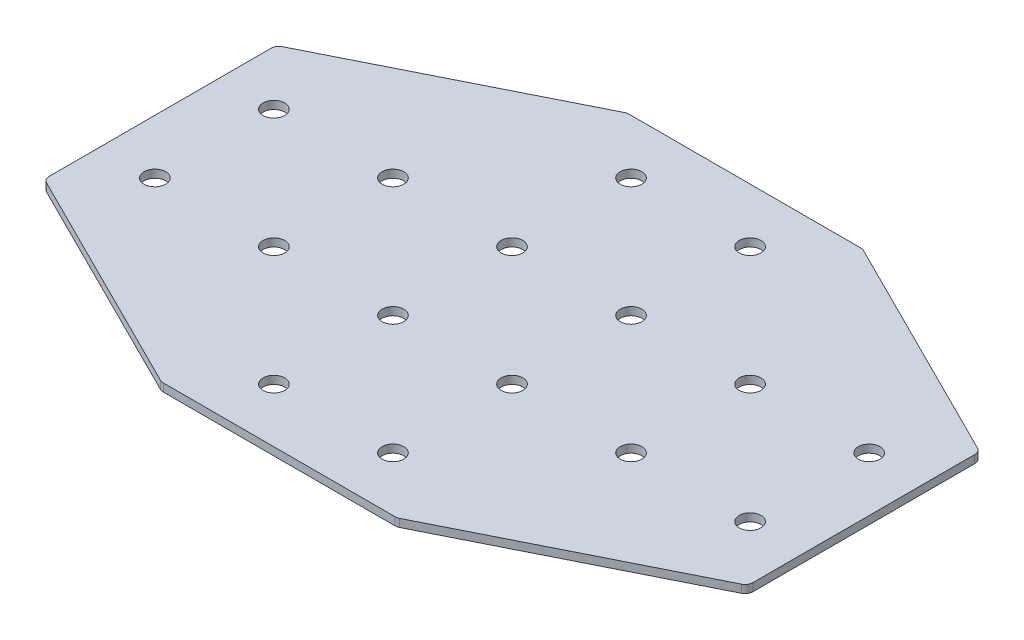
ISO-10303-21;
HEADER;
FILE_DESCRIPTION(('STEP AP214'),'2;1');
FILE_NAME('part.step','',(''),(''),'','','');
FILE_SCHEMA(('AUTOMOTIVE_DESIGN { 1 0 10303 214 1 1 1 1 }'));
ENDSEC;
DATA;
#1=APPLICATION_CONTEXT('core data for automotive mechanical design processes');
#2=APPLICATION_PROTOCOL_DEFINITION('international standard','automotive_design',2000,#1);
#3=PRODUCT_CONTEXT('',#1,'mechanical');
#4=PRODUCT('Part','Part','',(#3));
#5=PRODUCT_RELATED_PRODUCT_CATEGORY('part','',(#4));
#6=PRODUCT_DEFINITION_FORMATION('','',#4);
#7=PRODUCT_DEFINITION_CONTEXT('part definition',#1,'design');
#8=PRODUCT_DEFINITION('design','',#6,#7);
#9=PRODUCT_DEFINITION_SHAPE('','',#8);
#10=(LENGTH_UNIT() NAMED_UNIT(*) SI_UNIT(.MILLI.,.METRE.));
#11=(NAMED_UNIT(*) PLANE_ANGLE_UNIT() SI_UNIT($,.RADIAN.));
#12=(NAMED_UNIT(*) SI_UNIT($,.STERADIAN.) SOLID_ANGLE_UNIT());
#13=UNCERTAINTY_MEASURE_WITH_UNIT(LENGTH_MEASURE(1.E-05),#10,'distance_accuracy_value','');
#14=(GEOMETRIC_REPRESENTATION_CONTEXT(3) GLOBAL_UNCERTAINTY_ASSIGNED_CONTEXT((#13)) GLOBAL_UNIT_ASSIGNED_CONTEXT((#10,
#11,#12)) REPRESENTATION_CONTEXT('',''));
#15=CARTESIAN_POINT('',(0.,0.,0.));
#16=DIRECTION('',(0.,0.,1.));
#17=DIRECTION('',(1.,0.,0.));
#18=AXIS2_PLACEMENT_3D('',#15,#16,#17);
#19=CARTESIAN_POINT('',(-1.5038164553971,0.55807034319605,-0.553919420894999));
#20=DIRECTION('',(0.,-1.,0.));
#21=DIRECTION('',(0.,0.,-1.));
#22=AXIS2_PLACEMENT_3D('',#19,#20,#21);
#23=PLANE('',#22);
#24=CARTESIAN_POINT('',(-24.0038164553971,0.55807034319605,21.946080579105));
#25=DIRECTION('',(0.,-1.,0.));
#26=DIRECTION('',(0.,0.,1.));
#27=AXIS2_PLACEMENT_3D('',#24,#25,#26);
#28=CIRCLE('',#27,4.1);
#29=CARTESIAN_POINT('',(-24.0038164553971,0.55807034319605,26.046080579105));
#30=VERTEX_POINT('',#29);
#31=EDGE_CURVE('E140',#30,#30,#28,.T.);
#32=ORIENTED_EDGE('',*,*,#31,.F.);
#33=EDGE_LOOP('',(#32));
#34=FACE_BOUND('',#33,.T.);
#35=CARTESIAN_POINT('',(-24.0038164553971,0.55807034319605,66.946080579105));
#36=DIRECTION('',(0.,-1.,0.));
#37=DIRECTION('',(0.,0.,1.));
#38=AXIS2_PLACEMENT_3D('',#35,#36,#37);
#39=CIRCLE('',#38,4.1);
#40=CARTESIAN_POINT('',(-24.0038164553971,0.55807034319605,71.046080579105));
#41=VERTEX_POINT('',#40);
#42=EDGE_CURVE('E243',#41,#41,#39,.T.);
#43=ORIENTED_EDGE('',*,*,#42,.F.);
#44=EDGE_LOOP('',(#43));
#45=FACE_BOUND('',#44,.T.);
#46=CARTESIAN_POINT('',(-69.0038164553971,0.55807034319605,21.946080579105));
#47=DIRECTION('',(0.,-1.,0.));
#48=DIRECTION('',(0.,0.,1.));
#49=AXIS2_PLACEMENT_3D('',#46,#47,#48);
#50=CIRCLE('',#49,4.09999999999999);
#51=CARTESIAN_POINT('',(-69.0038164553971,0.55807034319605,26.046080579105));
#52=VERTEX_POINT('',#51);
#53=EDGE_CURVE('E237',#52,#52,#50,.T.);
#54=ORIENTED_EDGE('',*,*,#53,.F.);
#55=EDGE_LOOP('',(#54));
#56=FACE_BOUND('',#55,.T.);
#57=CARTESIAN_POINT('',(-114.003816455397,0.55807034319605,21.946080579105));
#58=DIRECTION('',(0.,-1.,0.));
#59=DIRECTION('',(0.,0.,1.));
#60=AXIS2_PLACEMENT_3D('',#57,#58,#59);
#61=CIRCLE('',#60,4.1);
#62=CARTESIAN_POINT('',(-114.003816455397,0.55807034319605,26.046080579105));
#63=VERTEX_POINT('',#62);
#64=EDGE_CURVE('E231',#63,#63,#61,.T.);
#65=ORIENTED_EDGE('',*,*,#64,.F.);
#66=EDGE_LOOP('',(#65));
#67=FACE_BOUND('',#66,.T.);
#68=CARTESIAN_POINT('',(20.9961835446029,0.55807034319605,21.946080579105));
#69=DIRECTION('',(0.,1.,0.));
#70=DIRECTION('',(0.,0.,1.));
#71=AXIS2_PLACEMENT_3D('',#68,#69,#70);
#72=CIRCLE('',#71,4.1);
#73=CARTESIAN_POINT('',(20.9961835446029,0.55807034319605,26.046080579105));
#74=VERTEX_POINT('',#73);
#75=EDGE_CURVE('E298',#74,#74,#72,.T.);
#76=ORIENTED_EDGE('',*,*,#75,.T.);
#77=EDGE_LOOP('',(#76));
#78=FACE_BOUND('',#77,.T.);
#79=CARTESIAN_POINT('',(20.9961835446029,0.55807034319605,66.946080579105));
#80=DIRECTION('',(0.,1.,0.));
#81=DIRECTION('',(0.,0.,1.));
#82=AXIS2_PLACEMENT_3D('',#79,#80,#81);
#83=CIRCLE('',#82,4.1);
#84=CARTESIAN_POINT('',(20.9961835446029,0.55807034319605,71.046080579105));
#85=VERTEX_POINT('',#84);
#86=EDGE_CURVE('E292',#85,#85,#83,.T.);
#87=ORIENTED_EDGE('',*,*,#86,.T.);
#88=EDGE_LOOP('',(#87));
#89=FACE_BOUND('',#88,.T.);
#90=CARTESIAN_POINT('',(65.9961835446029,0.55807034319605,21.946080579105));
#91=DIRECTION('',(0.,1.,0.));
#92=DIRECTION('',(0.,0.,1.));
#93=AXIS2_PLACEMENT_3D('',#90,#91,#92);
#94=CIRCLE('',#93,4.09999999999999);
#95=CARTESIAN_POINT('',(65.9961835446029,0.55807034319605,26.046080579105));
#96=VERTEX_POINT('',#95);
#97=EDGE_CURVE('E286',#96,#96,#94,.T.);
#98=ORIENTED_EDGE('',*,*,#97,.T.);
#99=EDGE_LOOP('',(#98));
#100=FACE_BOUND('',#99,.T.);
#101=CARTESIAN_POINT('',(110.996183544603,0.55807034319605,21.946080579105));
#102=DIRECTION('',(0.,1.,0.));
#103=DIRECTION('',(0.,0.,1.));
#104=AXIS2_PLACEMENT_3D('',#101,#102,#103);
#105=CIRCLE('',#104,4.1);
#106=CARTESIAN_POINT('',(110.996183544603,0.55807034319605,26.046080579105));
#107=VERTEX_POINT('',#106);
#108=EDGE_CURVE('E280',#107,#107,#105,.T.);
#109=ORIENTED_EDGE('',*,*,#108,.T.);
#110=EDGE_LOOP('',(#109));
#111=FACE_BOUND('',#110,.T.);
#112=DIRECTION('',(0.,0.,-1.));
#113=VECTOR('',#112,1.);
#114=CARTESIAN_POINT('',(-134.503816455397,0.55807034319605,43.2100126016053));
#115=LINE('',#114,#113);
#116=CARTESIAN_POINT('',(-134.503816455397,0.55807034319605,41.3559106353556));
#117=VERTEX_POINT('',#116);
#118=CARTESIAN_POINT('',(-134.503816455397,0.55807034319605,-42.4637494771456));
#119=VERTEX_POINT('',#118);
#120=EDGE_CURVE('E253',#117,#119,#115,.T.);
#121=ORIENTED_EDGE('',*,*,#120,.T.);
#122=CARTESIAN_POINT('',(-131.503816455397,0.55807034319605,-42.4637494771456));
#123=DIRECTION('',(0.,-1.,0.));
#124=DIRECTION('',(0.,0.,1.));
#125=AXIS2_PLACEMENT_3D('',#122,#123,#124);
#126=CIRCLE('',#125,3.);
#127=CARTESIAN_POINT('',(-132.845457241897,0.55807034319605,-45.1470310501454));
#128=VERTEX_POINT('',#127);
#129=EDGE_CURVE('E148',#119,#128,#126,.T.);
#130=ORIENTED_EDGE('',*,*,#129,.T.);
#131=DIRECTION('',(-0.894427190999916,0.,0.447213595499958));
#132=VECTOR('',#131,1.);
#133=CARTESIAN_POINT('',(-46.0316805003976,0.55807034319605,-88.553919420895));
#134=LINE('',#133,#132);
#135=CARTESIAN_POINT('',(-46.6651173543981,0.55807034319605,-88.2372009938947));
#136=VERTEX_POINT('',#135);
#137=EDGE_CURVE('E158',#136,#128,#134,.T.);
#138=ORIENTED_EDGE('',*,*,#137,.F.);
#139=CARTESIAN_POINT('',(-45.3234765678982,0.55807034319605,-85.553919420895));
#140=DIRECTION('',(0.,-1.,0.));
#141=DIRECTION('',(0.,0.,1.));
#142=AXIS2_PLACEMENT_3D('',#139,#140,#141);
#143=CIRCLE('',#142,3.);
#144=CARTESIAN_POINT('',(-45.3234765678982,0.55807034319605,-88.553919420895));
#145=VERTEX_POINT('',#144);
#146=EDGE_CURVE('E168',#136,#145,#143,.T.);
#147=ORIENTED_EDGE('',*,*,#146,.T.);
#148=DIRECTION('',(1.,0.,0.));
#149=VECTOR('',#148,1.);
#150=CARTESIAN_POINT('',(-44.5038164553972,0.55807034319605,-88.553919420895));
#151=LINE('',#150,#149);
#152=CARTESIAN_POINT('',(42.3158436571041,0.55807034319605,-88.553919420895));
#153=VERTEX_POINT('',#152);
#154=EDGE_CURVE('E198',#145,#153,#151,.T.);
#155=ORIENTED_EDGE('',*,*,#154,.T.);
#156=CARTESIAN_POINT('',(42.3158436571041,0.55807034319605,-85.553919420895));
#157=DIRECTION('',(0.,1.,0.));
#158=DIRECTION('',(0.,0.,1.));
#159=AXIS2_PLACEMENT_3D('',#156,#157,#158);
#160=CIRCLE('',#159,3.);
#161=CARTESIAN_POINT('',(43.6574844436039,0.55807034319605,-88.2372009938947));
#162=VERTEX_POINT('',#161);
#163=EDGE_CURVE('E220',#162,#153,#160,.T.);
#164=ORIENTED_EDGE('',*,*,#163,.F.);
#165=DIRECTION('',(0.894427190999916,0.,0.447213595499958));
#166=VECTOR('',#165,1.);
#167=CARTESIAN_POINT('',(43.0240475896034,0.55807034319605,-88.553919420895));
#168=LINE('',#167,#166);
#169=CARTESIAN_POINT('',(129.837824331103,0.55807034319605,-45.1470310501453));
#170=VERTEX_POINT('',#169);
#171=EDGE_CURVE('E201',#162,#170,#168,.T.);
#172=ORIENTED_EDGE('',*,*,#171,.T.);
#173=CARTESIAN_POINT('',(128.496183544603,0.55807034319605,-42.4637494771456));
#174=DIRECTION('',(0.,1.,0.));
#175=DIRECTION('',(0.,0.,1.));
#176=AXIS2_PLACEMENT_3D('',#173,#174,#175);
#177=CIRCLE('',#176,3.);
#178=CARTESIAN_POINT('',(131.496183544603,0.55807034319605,-42.4637494771456));
#179=VERTEX_POINT('',#178);
#180=EDGE_CURVE('E217',#179,#170,#177,.T.);
#181=ORIENTED_EDGE('',*,*,#180,.F.);
#182=DIRECTION('',(0.,0.,-1.));
#183=VECTOR('',#182,1.);
#184=CARTESIAN_POINT('',(131.496183544603,0.55807034319605,43.2100126016053));
#185=LINE('',#184,#183);
#186=CARTESIAN_POINT('',(131.496183544603,0.55807034319605,41.3559106353556));
#187=VERTEX_POINT('',#186);
#188=EDGE_CURVE('E304',#187,#179,#185,.T.);
#189=ORIENTED_EDGE('',*,*,#188,.F.);
#190=CARTESIAN_POINT('',(128.496183544603,0.55807034319605,41.3559106353556));
#191=DIRECTION('',(0.,-1.,0.));
#192=DIRECTION('',(0.,0.,-1.));
#193=AXIS2_PLACEMENT_3D('',#190,#191,#192);
#194=CIRCLE('',#193,3.);
#195=CARTESIAN_POINT('',(129.837824331103,0.55807034319605,44.0391922083553));
#196=VERTEX_POINT('',#195);
#197=EDGE_CURVE('E31',#187,#196,#194,.T.);
#198=ORIENTED_EDGE('',*,*,#197,.T.);
#199=DIRECTION('',(0.894427190999916,0.,-0.447213595499958));
#200=VECTOR('',#199,1.);
#201=CARTESIAN_POINT('',(43.0240475896034,0.55807034319605,87.446080579105));
#202=LINE('',#201,#200);
#203=CARTESIAN_POINT('',(43.6574844436039,0.55807034319605,87.1293621521047));
#204=VERTEX_POINT('',#203);
#205=EDGE_CURVE('E309',#204,#196,#202,.T.);
#206=ORIENTED_EDGE('',*,*,#205,.F.);
#207=CARTESIAN_POINT('',(42.3158436571041,0.55807034319605,84.446080579105));
#208=DIRECTION('',(0.,-1.,0.));
#209=DIRECTION('',(0.,0.,-1.));
#210=AXIS2_PLACEMENT_3D('',#207,#208,#209);
#211=CIRCLE('',#210,3.);
#212=CARTESIAN_POINT('',(42.3158436571041,0.55807034319605,87.446080579105));
#213=VERTEX_POINT('',#212);
#214=EDGE_CURVE('E324',#204,#213,#211,.T.);
#215=ORIENTED_EDGE('',*,*,#214,.T.);
#216=DIRECTION('',(1.,0.,0.));
#217=VECTOR('',#216,1.);
#218=CARTESIAN_POINT('',(-44.5038164553972,0.55807034319605,87.446080579105));
#219=LINE('',#218,#217);
#220=CARTESIAN_POINT('',(-45.3234765678982,0.55807034319605,87.446080579105));
#221=VERTEX_POINT('',#220);
#222=EDGE_CURVE('E306',#221,#213,#219,.T.);
#223=ORIENTED_EDGE('',*,*,#222,.F.);
#224=CARTESIAN_POINT('',(-45.3234765678982,0.55807034319605,84.446080579105));
#225=DIRECTION('',(0.,1.,0.));
#226=DIRECTION('',(0.,0.,-1.));
#227=AXIS2_PLACEMENT_3D('',#224,#225,#226);
#228=CIRCLE('',#227,3.);
#229=CARTESIAN_POINT('',(-46.6651173543981,0.55807034319605,87.1293621521047));
#230=VERTEX_POINT('',#229);
#231=EDGE_CURVE('E270',#230,#221,#228,.T.);
#232=ORIENTED_EDGE('',*,*,#231,.F.);
#233=DIRECTION('',(-0.894427190999916,0.,-0.447213595499958));
#234=VECTOR('',#233,1.);
#235=CARTESIAN_POINT('',(-46.0316805003976,0.55807034319605,87.446080579105));
#236=LINE('',#235,#234);
#237=CARTESIAN_POINT('',(-132.845457241897,0.55807034319605,44.0391922083554));
#238=VERTEX_POINT('',#237);
#239=EDGE_CURVE('E255',#230,#238,#236,.T.);
#240=ORIENTED_EDGE('',*,*,#239,.T.);
#241=CARTESIAN_POINT('',(-131.503816455397,0.55807034319605,41.3559106353556));
#242=DIRECTION('',(0.,1.,0.));
#243=DIRECTION('',(0.,0.,-1.));
#244=AXIS2_PLACEMENT_3D('',#241,#242,#243);
#245=CIRCLE('',#244,3.);
#246=EDGE_CURVE('E267',#117,#238,#245,.T.);
#247=ORIENTED_EDGE('',*,*,#246,.F.);
#248=EDGE_LOOP('',(#121,#130,#138,#147,#155,#164,#172,#181,#189,#198,#206,#215,#223,#232,#240,#247));
#249=FACE_BOUND('',#248,.T.);
#250=CARTESIAN_POINT('',(-24.0038164553971,0.55807034319605,-23.053919420895));
#251=DIRECTION('',(0.,1.,0.));
#252=DIRECTION('',(0.,0.,-1.));
#253=AXIS2_PLACEMENT_3D('',#250,#251,#252);
#254=CIRCLE('',#253,4.1);
#255=CARTESIAN_POINT('',(-24.0038164553971,0.55807034319605,-27.153919420895));
#256=VERTEX_POINT('',#255);
#257=EDGE_CURVE('E352',#256,#256,#254,.T.);
#258=ORIENTED_EDGE('',*,*,#257,.T.);
#259=EDGE_LOOP('',(#258));
#260=FACE_BOUND('',#259,.T.);
#261=CARTESIAN_POINT('',(-24.0038164553971,0.55807034319605,-68.053919420895));
#262=DIRECTION('',(0.,1.,0.));
#263=DIRECTION('',(0.,0.,-1.));
#264=AXIS2_PLACEMENT_3D('',#261,#262,#263);
#265=CIRCLE('',#264,4.1);
#266=CARTESIAN_POINT('',(-24.0038164553971,0.55807034319605,-72.153919420895));
#267=VERTEX_POINT('',#266);
#268=EDGE_CURVE('E356',#267,#267,#265,.T.);
#269=ORIENTED_EDGE('',*,*,#268,.T.);
#270=EDGE_LOOP('',(#269));
#271=FACE_BOUND('',#270,.T.);
#272=CARTESIAN_POINT('',(-69.0038164553971,0.55807034319605,-23.053919420895));
#273=DIRECTION('',(0.,1.,0.));
#274=DIRECTION('',(0.,0.,-1.));
#275=AXIS2_PLACEMENT_3D('',#272,#273,#274);
#276=CIRCLE('',#275,4.09999999999999);
#277=CARTESIAN_POINT('',(-69.0038164553971,0.55807034319605,-27.153919420895));
#278=VERTEX_POINT('',#277);
#279=EDGE_CURVE('E360',#278,#278,#276,.T.);
#280=ORIENTED_EDGE('',*,*,#279,.T.);
#281=EDGE_LOOP('',(#280));
#282=FACE_BOUND('',#281,.T.);
#283=CARTESIAN_POINT('',(-114.003816455397,0.55807034319605,-23.053919420895));
#284=DIRECTION('',(0.,1.,0.));
#285=DIRECTION('',(0.,0.,-1.));
#286=AXIS2_PLACEMENT_3D('',#283,#284,#285);
#287=CIRCLE('',#286,4.1);
#288=CARTESIAN_POINT('',(-114.003816455397,0.55807034319605,-27.153919420895));
#289=VERTEX_POINT('',#288);
#290=EDGE_CURVE('E364',#289,#289,#287,.T.);
#291=ORIENTED_EDGE('',*,*,#290,.T.);
#292=EDGE_LOOP('',(#291));
#293=FACE_BOUND('',#292,.T.);
#294=CARTESIAN_POINT('',(20.9961835446029,0.55807034319605,-23.053919420895));
#295=DIRECTION('',(0.,-1.,0.));
#296=DIRECTION('',(0.,0.,-1.));
#297=AXIS2_PLACEMENT_3D('',#294,#295,#296);
#298=CIRCLE('',#297,4.1);
#299=CARTESIAN_POINT('',(20.9961835446029,0.55807034319605,-27.153919420895));
#300=VERTEX_POINT('',#299);
#301=EDGE_CURVE('E192',#300,#300,#298,.T.);
#302=ORIENTED_EDGE('',*,*,#301,.F.);
#303=EDGE_LOOP('',(#302));
#304=FACE_BOUND('',#303,.T.);
#305=CARTESIAN_POINT('',(20.9961835446029,0.55807034319605,-68.053919420895));
#306=DIRECTION('',(0.,-1.,0.));
#307=DIRECTION('',(0.,0.,-1.));
#308=AXIS2_PLACEMENT_3D('',#305,#306,#307);
#309=CIRCLE('',#308,4.1);
#310=CARTESIAN_POINT('',(20.9961835446029,0.55807034319605,-72.153919420895));
#311=VERTEX_POINT('',#310);
#312=EDGE_CURVE('E186',#311,#311,#309,.T.);
#313=ORIENTED_EDGE('',*,*,#312,.F.);
#314=EDGE_LOOP('',(#313));
#315=FACE_BOUND('',#314,.T.);
#316=CARTESIAN_POINT('',(65.9961835446029,0.55807034319605,-23.053919420895));
#317=DIRECTION('',(0.,-1.,0.));
#318=DIRECTION('',(0.,0.,-1.));
#319=AXIS2_PLACEMENT_3D('',#316,#317,#318);
#320=CIRCLE('',#319,4.09999999999999);
#321=CARTESIAN_POINT('',(65.9961835446029,0.55807034319605,-27.153919420895));
#322=VERTEX_POINT('',#321);
#323=EDGE_CURVE('E180',#322,#322,#320,.T.);
#324=ORIENTED_EDGE('',*,*,#323,.F.);
#325=EDGE_LOOP('',(#324));
#326=FACE_BOUND('',#325,.T.);
#327=CARTESIAN_POINT('',(110.996183544603,0.55807034319605,-23.053919420895));
#328=DIRECTION('',(0.,-1.,0.));
#329=DIRECTION('',(0.,0.,-1.));
#330=AXIS2_PLACEMENT_3D('',#327,#328,#329);
#331=CIRCLE('',#330,4.1);
#332=CARTESIAN_POINT('',(110.996183544603,0.55807034319605,-27.153919420895));
#333=VERTEX_POINT('',#332);
#334=EDGE_CURVE('E174',#333,#333,#331,.T.);
#335=ORIENTED_EDGE('',*,*,#334,.F.);
#336=EDGE_LOOP('',(#335));
#337=FACE_BOUND('',#336,.T.);
#338=ADVANCED_FACE('F16',(#34,#45,#56,#67,#78,#89,#100,#111,#249,#260,#271,#282,#293,#304,#315,
#326,#337),#23,.T.);
#339=CARTESIAN_POINT('',(131.496183544603,0.55807034319605,43.2100126016053));
#340=DIRECTION('',(1.,0.,0.));
#341=DIRECTION('',(0.,0.,-1.));
#342=AXIS2_PLACEMENT_3D('',#339,#340,#341);
#343=PLANE('',#342);
#344=ORIENTED_EDGE('',*,*,#188,.T.);
#345=DIRECTION('',(0.,1.,0.));
#346=VECTOR('',#345,1.);
#347=CARTESIAN_POINT('',(131.496183544603,0.55807034319605,-42.4637494771456));
#348=LINE('',#347,#346);
#349=CARTESIAN_POINT('',(131.496183544603,3.55807034319605,-42.4637494771456));
#350=VERTEX_POINT('',#349);
#351=EDGE_CURVE('E227',#350,#179,#348,.F.);
#352=ORIENTED_EDGE('',*,*,#351,.F.);
#353=DIRECTION('',(0.,0.,-1.));
#354=VECTOR('',#353,1.);
#355=CARTESIAN_POINT('',(131.496183544603,3.55807034319605,43.2100126016053));
#356=LINE('',#355,#354);
#357=CARTESIAN_POINT('',(131.496183544603,3.55807034319605,41.3559106353556));
#358=VERTEX_POINT('',#357);
#359=EDGE_CURVE('E301',#358,#350,#356,.T.);
#360=ORIENTED_EDGE('',*,*,#359,.F.);
#361=DIRECTION('',(0.,1.,0.));
#362=VECTOR('',#361,1.);
#363=CARTESIAN_POINT('',(131.496183544603,0.55807034319605,41.3559106353556));
#364=LINE('',#363,#362);
#365=EDGE_CURVE('E10',#358,#187,#364,.F.);
#366=ORIENTED_EDGE('',*,*,#365,.T.);
#367=EDGE_LOOP('',(#344,#352,#360,#366));
#368=FACE_BOUND('',#367,.T.);
#369=ADVANCED_FACE('F346',(#368),#343,.T.);
#370=CARTESIAN_POINT('',(-1.5038164553971,3.55807034319605,-0.553919420894999));
#371=DIRECTION('',(0.,-1.,0.));
#372=DIRECTION('',(0.,0.,-1.));
#373=AXIS2_PLACEMENT_3D('',#370,#371,#372);
#374=PLANE('',#373);
#375=CARTESIAN_POINT('',(-24.0038164553971,3.55807034319605,21.946080579105));
#376=DIRECTION('',(0.,-1.,0.));
#377=DIRECTION('',(0.,0.,1.));
#378=AXIS2_PLACEMENT_3D('',#375,#376,#377);
#379=CIRCLE('',#378,4.1);
#380=CARTESIAN_POINT('',(-24.0038164553971,3.55807034319605,26.046080579105));
#381=VERTEX_POINT('',#380);
#382=EDGE_CURVE('E246',#381,#381,#379,.T.);
#383=ORIENTED_EDGE('',*,*,#382,.T.);
#384=EDGE_LOOP('',(#383));
#385=FACE_BOUND('',#384,.T.);
#386=CARTESIAN_POINT('',(-24.0038164553971,3.55807034319605,66.946080579105));
#387=DIRECTION('',(0.,-1.,0.));
#388=DIRECTION('',(0.,0.,1.));
#389=AXIS2_PLACEMENT_3D('',#386,#387,#388);
#390=CIRCLE('',#389,4.1);
#391=CARTESIAN_POINT('',(-24.0038164553971,3.55807034319605,71.046080579105));
#392=VERTEX_POINT('',#391);
#393=EDGE_CURVE('E240',#392,#392,#390,.T.);
#394=ORIENTED_EDGE('',*,*,#393,.T.);
#395=EDGE_LOOP('',(#394));
#396=FACE_BOUND('',#395,.T.);
#397=CARTESIAN_POINT('',(-69.0038164553971,3.55807034319605,21.946080579105));
#398=DIRECTION('',(0.,-1.,0.));
#399=DIRECTION('',(0.,0.,1.));
#400=AXIS2_PLACEMENT_3D('',#397,#398,#399);
#401=CIRCLE('',#400,4.09999999999999);
#402=CARTESIAN_POINT('',(-69.0038164553971,3.55807034319605,26.046080579105));
#403=VERTEX_POINT('',#402);
#404=EDGE_CURVE('E234',#403,#403,#401,.T.);
#405=ORIENTED_EDGE('',*,*,#404,.T.);
#406=EDGE_LOOP('',(#405));
#407=FACE_BOUND('',#406,.T.);
#408=CARTESIAN_POINT('',(-114.003816455397,3.55807034319605,21.946080579105));
#409=DIRECTION('',(0.,-1.,0.));
#410=DIRECTION('',(0.,0.,1.));
#411=AXIS2_PLACEMENT_3D('',#408,#409,#410);
#412=CIRCLE('',#411,4.1);
#413=CARTESIAN_POINT('',(-114.003816455397,3.55807034319605,26.046080579105));
#414=VERTEX_POINT('',#413);
#415=EDGE_CURVE('E230',#414,#414,#412,.T.);
#416=ORIENTED_EDGE('',*,*,#415,.T.);
#417=EDGE_LOOP('',(#416));
#418=FACE_BOUND('',#417,.T.);
#419=CARTESIAN_POINT('',(20.9961835446029,3.55807034319605,21.946080579105));
#420=DIRECTION('',(0.,1.,0.));
#421=DIRECTION('',(0.,0.,1.));
#422=AXIS2_PLACEMENT_3D('',#419,#420,#421);
#423=CIRCLE('',#422,4.1);
#424=CARTESIAN_POINT('',(20.9961835446029,3.55807034319605,26.046080579105));
#425=VERTEX_POINT('',#424);
#426=EDGE_CURVE('E295',#425,#425,#423,.T.);
#427=ORIENTED_EDGE('',*,*,#426,.F.);
#428=EDGE_LOOP('',(#427));
#429=FACE_BOUND('',#428,.T.);
#430=CARTESIAN_POINT('',(20.9961835446029,3.55807034319605,66.946080579105));
#431=DIRECTION('',(0.,1.,0.));
#432=DIRECTION('',(0.,0.,1.));
#433=AXIS2_PLACEMENT_3D('',#430,#431,#432);
#434=CIRCLE('',#433,4.1);
#435=CARTESIAN_POINT('',(20.9961835446029,3.55807034319605,71.046080579105));
#436=VERTEX_POINT('',#435);
#437=EDGE_CURVE('E289',#436,#436,#434,.T.);
#438=ORIENTED_EDGE('',*,*,#437,.F.);
#439=EDGE_LOOP('',(#438));
#440=FACE_BOUND('',#439,.T.);
#441=CARTESIAN_POINT('',(65.9961835446029,3.55807034319605,21.946080579105));
#442=DIRECTION('',(0.,1.,0.));
#443=DIRECTION('',(0.,0.,1.));
#444=AXIS2_PLACEMENT_3D('',#441,#442,#443);
#445=CIRCLE('',#444,4.09999999999999);
#446=CARTESIAN_POINT('',(65.9961835446029,3.55807034319605,26.046080579105));
#447=VERTEX_POINT('',#446);
#448=EDGE_CURVE('E283',#447,#447,#445,.T.);
#449=ORIENTED_EDGE('',*,*,#448,.F.);
#450=EDGE_LOOP('',(#449));
#451=FACE_BOUND('',#450,.T.);
#452=CARTESIAN_POINT('',(110.996183544603,3.55807034319605,21.946080579105));
#453=DIRECTION('',(0.,1.,0.));
#454=DIRECTION('',(0.,0.,1.));
#455=AXIS2_PLACEMENT_3D('',#452,#453,#454);
#456=CIRCLE('',#455,4.1);
#457=CARTESIAN_POINT('',(110.996183544603,3.55807034319605,26.046080579105));
#458=VERTEX_POINT('',#457);
#459=EDGE_CURVE('E279',#458,#458,#456,.T.);
#460=ORIENTED_EDGE('',*,*,#459,.F.);
#461=EDGE_LOOP('',(#460));
#462=FACE_BOUND('',#461,.T.);
#463=ORIENTED_EDGE('',*,*,#359,.T.);
#464=CARTESIAN_POINT('',(128.496183544603,3.55807034319605,-42.4637494771456));
#465=DIRECTION('',(0.,1.,0.));
#466=DIRECTION('',(0.,0.,1.));
#467=AXIS2_PLACEMENT_3D('',#464,#465,#466);
#468=CIRCLE('',#467,3.);
#469=CARTESIAN_POINT('',(129.837824331103,3.55807034319605,-45.1470310501453));
#470=VERTEX_POINT('',#469);
#471=EDGE_CURVE('E205',#470,#350,#468,.F.);
#472=ORIENTED_EDGE('',*,*,#471,.F.);
#473=DIRECTION('',(0.894427190999916,0.,0.447213595499958));
#474=VECTOR('',#473,1.);
#475=CARTESIAN_POINT('',(43.0240475896034,3.55807034319605,-88.553919420895));
#476=LINE('',#475,#474);
#477=CARTESIAN_POINT('',(43.6574844436039,3.55807034319605,-88.2372009938947));
#478=VERTEX_POINT('',#477);
#479=EDGE_CURVE('E202',#478,#470,#476,.T.);
#480=ORIENTED_EDGE('',*,*,#479,.F.);
#481=CARTESIAN_POINT('',(42.3158436571041,3.55807034319605,-85.553919420895));
#482=DIRECTION('',(0.,1.,0.));
#483=DIRECTION('',(0.,0.,1.));
#484=AXIS2_PLACEMENT_3D('',#481,#482,#483);
#485=CIRCLE('',#484,3.);
#486=CARTESIAN_POINT('',(42.3158436571041,3.55807034319605,-88.553919420895));
#487=VERTEX_POINT('',#486);
#488=EDGE_CURVE('E212',#487,#478,#485,.F.);
#489=ORIENTED_EDGE('',*,*,#488,.F.);
#490=DIRECTION('',(1.,0.,0.));
#491=VECTOR('',#490,1.);
#492=CARTESIAN_POINT('',(-44.5038164553972,3.55807034319605,-88.553919420895));
#493=LINE('',#492,#491);
#494=CARTESIAN_POINT('',(-45.3234765678982,3.55807034319605,-88.553919420895));
#495=VERTEX_POINT('',#494);
#496=EDGE_CURVE('E195',#495,#487,#493,.T.);
#497=ORIENTED_EDGE('',*,*,#496,.F.);
#498=CARTESIAN_POINT('',(-45.3234765678982,3.55807034319605,-85.553919420895));
#499=DIRECTION('',(0.,-1.,0.));
#500=DIRECTION('',(0.,0.,1.));
#501=AXIS2_PLACEMENT_3D('',#498,#499,#500);
#502=CIRCLE('',#501,3.);
#503=CARTESIAN_POINT('',(-46.6651173543981,3.55807034319605,-88.2372009938947));
#504=VERTEX_POINT('',#503);
#505=EDGE_CURVE('E157',#495,#504,#502,.F.);
#506=ORIENTED_EDGE('',*,*,#505,.T.);
#507=DIRECTION('',(-0.894427190999916,0.,0.447213595499958));
#508=VECTOR('',#507,1.);
#509=CARTESIAN_POINT('',(-46.0316805003976,3.55807034319605,-88.553919420895));
#510=LINE('',#509,#508);
#511=CARTESIAN_POINT('',(-132.845457241897,3.55807034319605,-45.1470310501454));
#512=VERTEX_POINT('',#511);
#513=EDGE_CURVE('E156',#504,#512,#510,.T.);
#514=ORIENTED_EDGE('',*,*,#513,.T.);
#515=CARTESIAN_POINT('',(-131.503816455397,3.55807034319605,-42.4637494771456));
#516=DIRECTION('',(0.,-1.,0.));
#517=DIRECTION('',(0.,0.,1.));
#518=AXIS2_PLACEMENT_3D('',#515,#516,#517);
#519=CIRCLE('',#518,3.);
#520=CARTESIAN_POINT('',(-134.503816455397,3.55807034319605,-42.4637494771456));
#521=VERTEX_POINT('',#520);
#522=EDGE_CURVE('E145',#512,#521,#519,.F.);
#523=ORIENTED_EDGE('',*,*,#522,.T.);
#524=DIRECTION('',(0.,0.,-1.));
#525=VECTOR('',#524,1.);
#526=CARTESIAN_POINT('',(-134.503816455397,3.55807034319605,43.2100126016053));
#527=LINE('',#526,#525);
#528=CARTESIAN_POINT('',(-134.503816455397,3.55807034319605,41.3559106353556));
#529=VERTEX_POINT('',#528);
#530=EDGE_CURVE('E130',#529,#521,#527,.T.);
#531=ORIENTED_EDGE('',*,*,#530,.F.);
#532=CARTESIAN_POINT('',(-131.503816455397,3.55807034319605,41.3559106353556));
#533=DIRECTION('',(0.,1.,0.));
#534=DIRECTION('',(0.,0.,-1.));
#535=AXIS2_PLACEMENT_3D('',#532,#533,#534);
#536=CIRCLE('',#535,3.);
#537=CARTESIAN_POINT('',(-132.845457241897,3.55807034319605,44.0391922083554));
#538=VERTEX_POINT('',#537);
#539=EDGE_CURVE('E257',#538,#529,#536,.F.);
#540=ORIENTED_EDGE('',*,*,#539,.F.);
#541=DIRECTION('',(-0.894427190999916,0.,-0.447213595499958));
#542=VECTOR('',#541,1.);
#543=CARTESIAN_POINT('',(-46.0316805003976,3.55807034319605,87.446080579105));
#544=LINE('',#543,#542);
#545=CARTESIAN_POINT('',(-46.6651173543981,3.55807034319605,87.1293621521047));
#546=VERTEX_POINT('',#545);
#547=EDGE_CURVE('E139',#546,#538,#544,.T.);
#548=ORIENTED_EDGE('',*,*,#547,.F.);
#549=CARTESIAN_POINT('',(-45.3234765678982,3.55807034319605,84.446080579105));
#550=DIRECTION('',(0.,1.,0.));
#551=DIRECTION('',(0.,0.,-1.));
#552=AXIS2_PLACEMENT_3D('',#549,#550,#551);
#553=CIRCLE('',#552,3.);
#554=CARTESIAN_POINT('',(-45.3234765678982,3.55807034319605,87.446080579105));
#555=VERTEX_POINT('',#554);
#556=EDGE_CURVE('E262',#555,#546,#553,.F.);
#557=ORIENTED_EDGE('',*,*,#556,.F.);
#558=DIRECTION('',(1.,0.,0.));
#559=VECTOR('',#558,1.);
#560=CARTESIAN_POINT('',(-44.5038164553972,3.55807034319605,87.446080579105));
#561=LINE('',#560,#559);
#562=CARTESIAN_POINT('',(42.3158436571041,3.55807034319605,87.446080579105));
#563=VERTEX_POINT('',#562);
#564=EDGE_CURVE('E313',#555,#563,#561,.T.);
#565=ORIENTED_EDGE('',*,*,#564,.T.);
#566=CARTESIAN_POINT('',(42.3158436571041,3.55807034319605,84.446080579105));
#567=DIRECTION('',(0.,-1.,0.));
#568=DIRECTION('',(0.,0.,-1.));
#569=AXIS2_PLACEMENT_3D('',#566,#567,#568);
#570=CIRCLE('',#569,3.);
#571=CARTESIAN_POINT('',(43.6574844436039,3.55807034319605,87.1293621521047));
#572=VERTEX_POINT('',#571);
#573=EDGE_CURVE('E318',#563,#572,#570,.F.);
#574=ORIENTED_EDGE('',*,*,#573,.T.);
#575=DIRECTION('',(0.894427190999916,0.,-0.447213595499958));
#576=VECTOR('',#575,1.);
#577=CARTESIAN_POINT('',(43.0240475896034,3.55807034319605,87.446080579105));
#578=LINE('',#577,#576);
#579=CARTESIAN_POINT('',(129.837824331103,3.55807034319605,44.0391922083553));
#580=VERTEX_POINT('',#579);
#581=EDGE_CURVE('E307',#572,#580,#578,.T.);
#582=ORIENTED_EDGE('',*,*,#581,.T.);
#583=CARTESIAN_POINT('',(128.496183544603,3.55807034319605,41.3559106353556));
#584=DIRECTION('',(0.,-1.,0.));
#585=DIRECTION('',(0.,0.,-1.));
#586=AXIS2_PLACEMENT_3D('',#583,#584,#585);
#587=CIRCLE('',#586,3.);
#588=EDGE_CURVE('E311',#580,#358,#587,.F.);
#589=ORIENTED_EDGE('',*,*,#588,.T.);
#590=EDGE_LOOP('',(#463,#472,#480,#489,#497,#506,#514,#523,#531,#540,#548,#557,#565,#574,#582,#589));
#591=FACE_BOUND('',#590,.T.);
#592=CARTESIAN_POINT('',(-24.0038164553971,3.55807034319605,-23.053919420895));
#593=DIRECTION('',(0.,1.,0.));
#594=DIRECTION('',(0.,0.,-1.));
#595=AXIS2_PLACEMENT_3D('',#592,#593,#594);
#596=CIRCLE('',#595,4.1);
#597=CARTESIAN_POINT('',(-24.0038164553971,3.55807034319605,-27.153919420895));
#598=VERTEX_POINT('',#597);
#599=EDGE_CURVE('E515',#598,#598,#596,.T.);
#600=ORIENTED_EDGE('',*,*,#599,.F.);
#601=EDGE_LOOP('',(#600));
#602=FACE_BOUND('',#601,.T.);
#603=CARTESIAN_POINT('',(-24.0038164553971,3.55807034319605,-68.053919420895));
#604=DIRECTION('',(0.,1.,0.));
#605=DIRECTION('',(0.,0.,-1.));
#606=AXIS2_PLACEMENT_3D('',#603,#604,#605);
#607=CIRCLE('',#606,4.1);
#608=CARTESIAN_POINT('',(-24.0038164553971,3.55807034319605,-72.153919420895));
#609=VERTEX_POINT('',#608);
#610=EDGE_CURVE('E511',#609,#609,#607,.T.);
#611=ORIENTED_EDGE('',*,*,#610,.F.);
#612=EDGE_LOOP('',(#611));
#613=FACE_BOUND('',#612,.T.);
#614=CARTESIAN_POINT('',(-69.0038164553971,3.55807034319605,-23.053919420895));
#615=DIRECTION('',(0.,1.,0.));
#616=DIRECTION('',(0.,0.,-1.));
#617=AXIS2_PLACEMENT_3D('',#614,#615,#616);
#618=CIRCLE('',#617,4.09999999999999);
#619=CARTESIAN_POINT('',(-69.0038164553971,3.55807034319605,-27.153919420895));
#620=VERTEX_POINT('',#619);
#621=EDGE_CURVE('E507',#620,#620,#618,.T.);
#622=ORIENTED_EDGE('',*,*,#621,.F.);
#623=EDGE_LOOP('',(#622));
#624=FACE_BOUND('',#623,.T.);
#625=CARTESIAN_POINT('',(-114.003816455397,3.55807034319605,-23.053919420895));
#626=DIRECTION('',(0.,1.,0.));
#627=DIRECTION('',(0.,0.,-1.));
#628=AXIS2_PLACEMENT_3D('',#625,#626,#627);
#629=CIRCLE('',#628,4.1);
#630=CARTESIAN_POINT('',(-114.003816455397,3.55807034319605,-27.153919420895));
#631=VERTEX_POINT('',#630);
#632=EDGE_CURVE('E504',#631,#631,#629,.T.);
#633=ORIENTED_EDGE('',*,*,#632,.F.);
#634=EDGE_LOOP('',(#633));
#635=FACE_BOUND('',#634,.T.);
#636=CARTESIAN_POINT('',(20.9961835446029,3.55807034319605,-23.053919420895));
#637=DIRECTION('',(0.,-1.,0.));
#638=DIRECTION('',(0.,0.,-1.));
#639=AXIS2_PLACEMENT_3D('',#636,#637,#638);
#640=CIRCLE('',#639,4.1);
#641=CARTESIAN_POINT('',(20.9961835446029,3.55807034319605,-27.153919420895));
#642=VERTEX_POINT('',#641);
#643=EDGE_CURVE('E189',#642,#642,#640,.T.);
#644=ORIENTED_EDGE('',*,*,#643,.T.);
#645=EDGE_LOOP('',(#644));
#646=FACE_BOUND('',#645,.T.);
#647=CARTESIAN_POINT('',(20.9961835446029,3.55807034319605,-68.053919420895));
#648=DIRECTION('',(0.,-1.,0.));
#649=DIRECTION('',(0.,0.,-1.));
#650=AXIS2_PLACEMENT_3D('',#647,#648,#649);
#651=CIRCLE('',#650,4.1);
#652=CARTESIAN_POINT('',(20.9961835446029,3.55807034319605,-72.153919420895));
#653=VERTEX_POINT('',#652);
#654=EDGE_CURVE('E183',#653,#653,#651,.T.);
#655=ORIENTED_EDGE('',*,*,#654,.T.);
#656=EDGE_LOOP('',(#655));
#657=FACE_BOUND('',#656,.T.);
#658=CARTESIAN_POINT('',(65.9961835446029,3.55807034319605,-23.053919420895));
#659=DIRECTION('',(0.,-1.,0.));
#660=DIRECTION('',(0.,0.,-1.));
#661=AXIS2_PLACEMENT_3D('',#658,#659,#660);
#662=CIRCLE('',#661,4.09999999999999);
#663=CARTESIAN_POINT('',(65.9961835446029,3.55807034319605,-27.153919420895));
#664=VERTEX_POINT('',#663);
#665=EDGE_CURVE('E177',#664,#664,#662,.T.);
#666=ORIENTED_EDGE('',*,*,#665,.T.);
#667=EDGE_LOOP('',(#666));
#668=FACE_BOUND('',#667,.T.);
#669=CARTESIAN_POINT('',(110.996183544603,3.55807034319605,-23.053919420895));
#670=DIRECTION('',(0.,-1.,0.));
#671=DIRECTION('',(0.,0.,-1.));
#672=AXIS2_PLACEMENT_3D('',#669,#670,#671);
#673=CIRCLE('',#672,4.1);
#674=CARTESIAN_POINT('',(110.996183544603,3.55807034319605,-27.153919420895));
#675=VERTEX_POINT('',#674);
#676=EDGE_CURVE('E149',#675,#675,#673,.T.);
#677=ORIENTED_EDGE('',*,*,#676,.T.);
#678=EDGE_LOOP('',(#677));
#679=FACE_BOUND('',#678,.T.);
#680=ADVANCED_FACE('F152',(#385,#396,#407,#418,#429,#440,#451,#462,#591,#602,#613,#624,#635,
#646,#657,#668,#679),#374,.F.);
#681=CARTESIAN_POINT('',(-134.503816455397,0.55807034319605,43.2100126016053));
#682=DIRECTION('',(-1.,0.,0.));
#683=DIRECTION('',(0.,0.,-1.));
#684=AXIS2_PLACEMENT_3D('',#681,#682,#683);
#685=PLANE('',#684);
#686=ORIENTED_EDGE('',*,*,#530,.T.);
#687=DIRECTION('',(0.,1.,0.));
#688=VECTOR('',#687,1.);
#689=CARTESIAN_POINT('',(-134.503816455397,0.55807034319605,-42.4637494771456));
#690=LINE('',#689,#688);
#691=EDGE_CURVE('E134',#521,#119,#690,.F.);
#692=ORIENTED_EDGE('',*,*,#691,.T.);
#693=ORIENTED_EDGE('',*,*,#120,.F.);
#694=DIRECTION('',(0.,1.,0.));
#695=VECTOR('',#694,1.);
#696=CARTESIAN_POINT('',(-134.503816455397,0.55807034319605,41.3559106353556));
#697=LINE('',#696,#695);
#698=EDGE_CURVE('E136',#529,#117,#697,.F.);
#699=ORIENTED_EDGE('',*,*,#698,.F.);
#700=EDGE_LOOP('',(#686,#692,#693,#699));
#701=FACE_BOUND('',#700,.T.);
#702=ADVANCED_FACE('F132',(#701),#685,.T.);
#703=CARTESIAN_POINT('',(43.0240475896034,0.55807034319605,87.446080579105));
#704=DIRECTION('',(0.447213595499958,0.,0.894427190999916));
#705=DIRECTION('',(0.894427190999916,0.,-0.447213595499958));
#706=AXIS2_PLACEMENT_3D('',#703,#704,#705);
#707=PLANE('',#706);
#708=ORIENTED_EDGE('',*,*,#581,.F.);
#709=DIRECTION('',(0.,1.,0.));
#710=VECTOR('',#709,1.);
#711=CARTESIAN_POINT('',(43.6574844436039,0.55807034319605,87.1293621521047));
#712=LINE('',#711,#710);
#713=EDGE_CURVE('E24',#572,#204,#712,.F.);
#714=ORIENTED_EDGE('',*,*,#713,.T.);
#715=ORIENTED_EDGE('',*,*,#205,.T.);
#716=DIRECTION('',(0.,1.,0.));
#717=VECTOR('',#716,1.);
#718=CARTESIAN_POINT('',(129.837824331103,0.55807034319605,44.0391922083553));
#719=LINE('',#718,#717);
#720=EDGE_CURVE('E327',#196,#580,#719,.T.);
#721=ORIENTED_EDGE('',*,*,#720,.T.);
#722=EDGE_LOOP('',(#708,#714,#715,#721));
#723=FACE_BOUND('',#722,.T.);
#724=ADVANCED_FACE('F330',(#723),#707,.T.);
#725=CARTESIAN_POINT('',(-44.5038164553972,0.55807034319605,87.446080579105));
#726=DIRECTION('',(0.,0.,1.));
#727=DIRECTION('',(1.,0.,0.));
#728=AXIS2_PLACEMENT_3D('',#725,#726,#727);
#729=PLANE('',#728);
#730=ORIENTED_EDGE('',*,*,#564,.F.);
#731=DIRECTION('',(0.,1.,0.));
#732=VECTOR('',#731,1.);
#733=CARTESIAN_POINT('',(-45.3234765678982,0.55807034319605,87.446080579105));
#734=LINE('',#733,#732);
#735=EDGE_CURVE('E264',#221,#555,#734,.T.);
#736=ORIENTED_EDGE('',*,*,#735,.F.);
#737=ORIENTED_EDGE('',*,*,#222,.T.);
#738=DIRECTION('',(0.,1.,0.));
#739=VECTOR('',#738,1.);
#740=CARTESIAN_POINT('',(42.3158436571041,0.55807034319605,87.446080579105));
#741=LINE('',#740,#739);
#742=EDGE_CURVE('E320',#213,#563,#741,.T.);
#743=ORIENTED_EDGE('',*,*,#742,.T.);
#744=EDGE_LOOP('',(#730,#736,#737,#743));
#745=FACE_BOUND('',#744,.T.);
#746=ADVANCED_FACE('F340',(#745),#729,.T.);
#747=CARTESIAN_POINT('',(42.3158436571041,0.55807034319605,84.446080579105));
#748=DIRECTION('',(0.,1.,0.));
#749=DIRECTION('',(0.,0.,1.));
#750=AXIS2_PLACEMENT_3D('',#747,#748,#749);
#751=CYLINDRICAL_SURFACE('',#750,3.);
#752=ORIENTED_EDGE('',*,*,#214,.F.);
#753=ORIENTED_EDGE('',*,*,#713,.F.);
#754=ORIENTED_EDGE('',*,*,#573,.F.);
#755=ORIENTED_EDGE('',*,*,#742,.F.);
#756=EDGE_LOOP('',(#752,#753,#754,#755));
#757=FACE_BOUND('',#756,.T.);
#758=ADVANCED_FACE('F338',(#757),#751,.T.);
#759=CARTESIAN_POINT('',(128.496183544603,0.55807034319605,41.3559106353556));
#760=DIRECTION('',(0.,1.,0.));
#761=DIRECTION('',(0.,0.,1.));
#762=AXIS2_PLACEMENT_3D('',#759,#760,#761);
#763=CYLINDRICAL_SURFACE('',#762,3.);
#764=ORIENTED_EDGE('',*,*,#197,.F.);
#765=ORIENTED_EDGE('',*,*,#365,.F.);
#766=ORIENTED_EDGE('',*,*,#588,.F.);
#767=ORIENTED_EDGE('',*,*,#720,.F.);
#768=EDGE_LOOP('',(#764,#765,#766,#767));
#769=FACE_BOUND('',#768,.T.);
#770=ADVANCED_FACE('F18',(#769),#763,.T.);
#771=CARTESIAN_POINT('',(20.9961835446029,0.55807034319605,21.946080579105));
#772=DIRECTION('',(0.,1.,0.));
#773=DIRECTION('',(0.,0.,1.));
#774=AXIS2_PLACEMENT_3D('',#771,#772,#773);
#775=CYLINDRICAL_SURFACE('',#774,4.1);
#776=ORIENTED_EDGE('',*,*,#75,.F.);
#777=EDGE_LOOP('',(#776));
#778=FACE_BOUND('',#777,.T.);
#779=ORIENTED_EDGE('',*,*,#426,.T.);
#780=EDGE_LOOP('',(#779));
#781=FACE_BOUND('',#780,.T.);
#782=ADVANCED_FACE('F399',(#778,#781),#775,.F.);
#783=CARTESIAN_POINT('',(20.9961835446029,0.55807034319605,66.946080579105));
#784=DIRECTION('',(0.,1.,0.));
#785=DIRECTION('',(0.,0.,1.));
#786=AXIS2_PLACEMENT_3D('',#783,#784,#785);
#787=CYLINDRICAL_SURFACE('',#786,4.1);
#788=ORIENTED_EDGE('',*,*,#86,.F.);
#789=EDGE_LOOP('',(#788));
#790=FACE_BOUND('',#789,.T.);
#791=ORIENTED_EDGE('',*,*,#437,.T.);
#792=EDGE_LOOP('',(#791));
#793=FACE_BOUND('',#792,.T.);
#794=ADVANCED_FACE('F407',(#790,#793),#787,.F.);
#795=CARTESIAN_POINT('',(65.9961835446029,0.55807034319605,21.946080579105));
#796=DIRECTION('',(0.,1.,0.));
#797=DIRECTION('',(0.,0.,1.));
#798=AXIS2_PLACEMENT_3D('',#795,#796,#797);
#799=CYLINDRICAL_SURFACE('',#798,4.09999999999999);
#800=ORIENTED_EDGE('',*,*,#97,.F.);
#801=EDGE_LOOP('',(#800));
#802=FACE_BOUND('',#801,.T.);
#803=ORIENTED_EDGE('',*,*,#448,.T.);
#804=EDGE_LOOP('',(#803));
#805=FACE_BOUND('',#804,.T.);
#806=ADVANCED_FACE('F411',(#802,#805),#799,.F.);
#807=CARTESIAN_POINT('',(110.996183544603,0.55807034319605,21.946080579105));
#808=DIRECTION('',(0.,1.,0.));
#809=DIRECTION('',(0.,0.,1.));
#810=AXIS2_PLACEMENT_3D('',#807,#808,#809);
#811=CYLINDRICAL_SURFACE('',#810,4.1);
#812=ORIENTED_EDGE('',*,*,#108,.F.);
#813=EDGE_LOOP('',(#812));
#814=FACE_BOUND('',#813,.T.);
#815=ORIENTED_EDGE('',*,*,#459,.T.);
#816=EDGE_LOOP('',(#815));
#817=FACE_BOUND('',#816,.T.);
#818=ADVANCED_FACE('F415',(#814,#817),#811,.F.);
#819=CARTESIAN_POINT('',(-46.0316805003976,0.55807034319605,87.446080579105));
#820=DIRECTION('',(-0.447213595499958,0.,0.894427190999916));
#821=DIRECTION('',(-0.894427190999916,0.,-0.447213595499958));
#822=AXIS2_PLACEMENT_3D('',#819,#820,#821);
#823=PLANE('',#822);
#824=ORIENTED_EDGE('',*,*,#547,.T.);
#825=DIRECTION('',(0.,1.,0.));
#826=VECTOR('',#825,1.);
#827=CARTESIAN_POINT('',(-132.845457241897,0.55807034319605,44.0391922083553));
#828=LINE('',#827,#826);
#829=EDGE_CURVE('E273',#238,#538,#828,.T.);
#830=ORIENTED_EDGE('',*,*,#829,.F.);
#831=ORIENTED_EDGE('',*,*,#239,.F.);
#832=DIRECTION('',(0.,1.,0.));
#833=VECTOR('',#832,1.);
#834=CARTESIAN_POINT('',(-46.6651173543981,0.55807034319605,87.1293621521047));
#835=LINE('',#834,#833);
#836=EDGE_CURVE('E276',#546,#230,#835,.F.);
#837=ORIENTED_EDGE('',*,*,#836,.F.);
#838=EDGE_LOOP('',(#824,#830,#831,#837));
#839=FACE_BOUND('',#838,.T.);
#840=ADVANCED_FACE('F419',(#839),#823,.T.);
#841=CARTESIAN_POINT('',(-45.3234765678982,0.55807034319605,84.446080579105));
#842=DIRECTION('',(0.,1.,0.));
#843=DIRECTION('',(0.,0.,1.));
#844=AXIS2_PLACEMENT_3D('',#841,#842,#843);
#845=CYLINDRICAL_SURFACE('',#844,3.);
#846=ORIENTED_EDGE('',*,*,#231,.T.);
#847=ORIENTED_EDGE('',*,*,#735,.T.);
#848=ORIENTED_EDGE('',*,*,#556,.T.);
#849=ORIENTED_EDGE('',*,*,#836,.T.);
#850=EDGE_LOOP('',(#846,#847,#848,#849));
#851=FACE_BOUND('',#850,.T.);
#852=ADVANCED_FACE('F425',(#851),#845,.T.);
#853=CARTESIAN_POINT('',(-131.503816455397,0.55807034319605,41.3559106353556));
#854=DIRECTION('',(0.,1.,0.));
#855=DIRECTION('',(0.,0.,1.));
#856=AXIS2_PLACEMENT_3D('',#853,#854,#855);
#857=CYLINDRICAL_SURFACE('',#856,3.);
#858=ORIENTED_EDGE('',*,*,#246,.T.);
#859=ORIENTED_EDGE('',*,*,#829,.T.);
#860=ORIENTED_EDGE('',*,*,#539,.T.);
#861=ORIENTED_EDGE('',*,*,#698,.T.);
#862=EDGE_LOOP('',(#858,#859,#860,#861));
#863=FACE_BOUND('',#862,.T.);
#864=ADVANCED_FACE('F421',(#863),#857,.T.);
#865=CARTESIAN_POINT('',(-24.0038164553971,0.55807034319605,21.946080579105));
#866=DIRECTION('',(0.,1.,0.));
#867=DIRECTION('',(0.,0.,1.));
#868=AXIS2_PLACEMENT_3D('',#865,#866,#867);
#869=CYLINDRICAL_SURFACE('',#868,4.1);
#870=ORIENTED_EDGE('',*,*,#31,.T.);
#871=EDGE_LOOP('',(#870));
#872=FACE_BOUND('',#871,.T.);
#873=ORIENTED_EDGE('',*,*,#382,.F.);
#874=EDGE_LOOP('',(#873));
#875=FACE_BOUND('',#874,.T.);
#876=ADVANCED_FACE('F424',(#872,#875),#869,.F.);
#877=CARTESIAN_POINT('',(-24.0038164553971,0.55807034319605,66.946080579105));
#878=DIRECTION('',(0.,1.,0.));
#879=DIRECTION('',(0.,0.,1.));
#880=AXIS2_PLACEMENT_3D('',#877,#878,#879);
#881=CYLINDRICAL_SURFACE('',#880,4.1);
#882=ORIENTED_EDGE('',*,*,#42,.T.);
#883=EDGE_LOOP('',(#882));
#884=FACE_BOUND('',#883,.T.);
#885=ORIENTED_EDGE('',*,*,#393,.F.);
#886=EDGE_LOOP('',(#885));
#887=FACE_BOUND('',#886,.T.);
#888=ADVANCED_FACE('F435',(#884,#887),#881,.F.);
#889=CARTESIAN_POINT('',(-69.0038164553971,0.55807034319605,21.946080579105));
#890=DIRECTION('',(0.,1.,0.));
#891=DIRECTION('',(0.,0.,1.));
#892=AXIS2_PLACEMENT_3D('',#889,#890,#891);
#893=CYLINDRICAL_SURFACE('',#892,4.09999999999999);
#894=ORIENTED_EDGE('',*,*,#53,.T.);
#895=EDGE_LOOP('',(#894));
#896=FACE_BOUND('',#895,.T.);
#897=ORIENTED_EDGE('',*,*,#404,.F.);
#898=EDGE_LOOP('',(#897));
#899=FACE_BOUND('',#898,.T.);
#900=ADVANCED_FACE('F439',(#896,#899),#893,.F.);
#901=CARTESIAN_POINT('',(-114.003816455397,0.55807034319605,21.946080579105));
#902=DIRECTION('',(0.,1.,0.));
#903=DIRECTION('',(0.,0.,1.));
#904=AXIS2_PLACEMENT_3D('',#901,#902,#903);
#905=CYLINDRICAL_SURFACE('',#904,4.1);
#906=ORIENTED_EDGE('',*,*,#64,.T.);
#907=EDGE_LOOP('',(#906));
#908=FACE_BOUND('',#907,.T.);
#909=ORIENTED_EDGE('',*,*,#415,.F.);
#910=EDGE_LOOP('',(#909));
#911=FACE_BOUND('',#910,.T.);
#912=ADVANCED_FACE('F443',(#908,#911),#905,.F.);
#913=CARTESIAN_POINT('',(43.0240475896034,0.55807034319605,-88.553919420895));
#914=DIRECTION('',(0.447213595499958,0.,-0.894427190999916));
#915=DIRECTION('',(0.894427190999916,0.,0.447213595499958));
#916=AXIS2_PLACEMENT_3D('',#913,#914,#915);
#917=PLANE('',#916);
#918=ORIENTED_EDGE('',*,*,#479,.T.);
#919=DIRECTION('',(0.,1.,0.));
#920=VECTOR('',#919,1.);
#921=CARTESIAN_POINT('',(129.837824331103,0.55807034319605,-45.1470310501453));
#922=LINE('',#921,#920);
#923=EDGE_CURVE('E223',#170,#470,#922,.T.);
#924=ORIENTED_EDGE('',*,*,#923,.F.);
#925=ORIENTED_EDGE('',*,*,#171,.F.);
#926=DIRECTION('',(0.,1.,0.));
#927=VECTOR('',#926,1.);
#928=CARTESIAN_POINT('',(43.6574844436039,0.55807034319605,-88.2372009938947));
#929=LINE('',#928,#927);
#930=EDGE_CURVE('E225',#478,#162,#929,.F.);
#931=ORIENTED_EDGE('',*,*,#930,.F.);
#932=EDGE_LOOP('',(#918,#924,#925,#931));
#933=FACE_BOUND('',#932,.T.);
#934=ADVANCED_FACE('F447',(#933),#917,.T.);
#935=CARTESIAN_POINT('',(-44.5038164553972,0.55807034319605,-88.553919420895));
#936=DIRECTION('',(0.,0.,-1.));
#937=DIRECTION('',(1.,0.,0.));
#938=AXIS2_PLACEMENT_3D('',#935,#936,#937);
#939=PLANE('',#938);
#940=ORIENTED_EDGE('',*,*,#496,.T.);
#941=DIRECTION('',(0.,1.,0.));
#942=VECTOR('',#941,1.);
#943=CARTESIAN_POINT('',(42.3158436571041,0.55807034319605,-88.553919420895));
#944=LINE('',#943,#942);
#945=EDGE_CURVE('E215',#153,#487,#944,.T.);
#946=ORIENTED_EDGE('',*,*,#945,.F.);
#947=ORIENTED_EDGE('',*,*,#154,.F.);
#948=DIRECTION('',(0.,1.,0.));
#949=VECTOR('',#948,1.);
#950=CARTESIAN_POINT('',(-45.3234765678982,0.55807034319605,-88.553919420895));
#951=LINE('',#950,#949);
#952=EDGE_CURVE('E160',#145,#495,#951,.T.);
#953=ORIENTED_EDGE('',*,*,#952,.T.);
#954=EDGE_LOOP('',(#940,#946,#947,#953));
#955=FACE_BOUND('',#954,.T.);
#956=ADVANCED_FACE('F457',(#955),#939,.T.);
#957=CARTESIAN_POINT('',(42.3158436571041,0.55807034319605,-85.553919420895));
#958=DIRECTION('',(0.,1.,0.));
#959=DIRECTION('',(0.,0.,-1.));
#960=AXIS2_PLACEMENT_3D('',#957,#958,#959);
#961=CYLINDRICAL_SURFACE('',#960,3.);
#962=ORIENTED_EDGE('',*,*,#163,.T.);
#963=ORIENTED_EDGE('',*,*,#945,.T.);
#964=ORIENTED_EDGE('',*,*,#488,.T.);
#965=ORIENTED_EDGE('',*,*,#930,.T.);
#966=EDGE_LOOP('',(#962,#963,#964,#965));
#967=FACE_BOUND('',#966,.T.);
#968=ADVANCED_FACE('F453',(#967),#961,.T.);
#969=CARTESIAN_POINT('',(128.496183544603,0.55807034319605,-42.4637494771456));
#970=DIRECTION('',(0.,1.,0.));
#971=DIRECTION('',(0.,0.,-1.));
#972=AXIS2_PLACEMENT_3D('',#969,#970,#971);
#973=CYLINDRICAL_SURFACE('',#972,3.);
#974=ORIENTED_EDGE('',*,*,#180,.T.);
#975=ORIENTED_EDGE('',*,*,#923,.T.);
#976=ORIENTED_EDGE('',*,*,#471,.T.);
#977=ORIENTED_EDGE('',*,*,#351,.T.);
#978=EDGE_LOOP('',(#974,#975,#976,#977));
#979=FACE_BOUND('',#978,.T.);
#980=ADVANCED_FACE('F449',(#979),#973,.T.);
#981=CARTESIAN_POINT('',(20.9961835446029,0.55807034319605,-23.053919420895));
#982=DIRECTION('',(0.,1.,0.));
#983=DIRECTION('',(0.,0.,-1.));
#984=AXIS2_PLACEMENT_3D('',#981,#982,#983);
#985=CYLINDRICAL_SURFACE('',#984,4.1);
#986=ORIENTED_EDGE('',*,*,#301,.T.);
#987=EDGE_LOOP('',(#986));
#988=FACE_BOUND('',#987,.T.);
#989=ORIENTED_EDGE('',*,*,#643,.F.);
#990=EDGE_LOOP('',(#989));
#991=FACE_BOUND('',#990,.T.);
#992=ADVANCED_FACE('F452',(#988,#991),#985,.F.);
#993=CARTESIAN_POINT('',(20.9961835446029,0.55807034319605,-68.053919420895));
#994=DIRECTION('',(0.,1.,0.));
#995=DIRECTION('',(0.,0.,-1.));
#996=AXIS2_PLACEMENT_3D('',#993,#994,#995);
#997=CYLINDRICAL_SURFACE('',#996,4.1);
#998=ORIENTED_EDGE('',*,*,#312,.T.);
#999=EDGE_LOOP('',(#998));
#1000=FACE_BOUND('',#999,.T.);
#1001=ORIENTED_EDGE('',*,*,#654,.F.);
#1002=EDGE_LOOP('',(#1001));
#1003=FACE_BOUND('',#1002,.T.);
#1004=ADVANCED_FACE('F467',(#1000,#1003),#997,.F.);
#1005=CARTESIAN_POINT('',(65.9961835446029,0.55807034319605,-23.053919420895));
#1006=DIRECTION('',(0.,1.,0.));
#1007=DIRECTION('',(0.,0.,-1.));
#1008=AXIS2_PLACEMENT_3D('',#1005,#1006,#1007);
#1009=CYLINDRICAL_SURFACE('',#1008,4.09999999999999);
#1010=ORIENTED_EDGE('',*,*,#323,.T.);
#1011=EDGE_LOOP('',(#1010));
#1012=FACE_BOUND('',#1011,.T.);
#1013=ORIENTED_EDGE('',*,*,#665,.F.);
#1014=EDGE_LOOP('',(#1013));
#1015=FACE_BOUND('',#1014,.T.);
#1016=ADVANCED_FACE('F377',(#1012,#1015),#1009,.F.);
#1017=CARTESIAN_POINT('',(110.996183544603,0.55807034319605,-23.053919420895));
#1018=DIRECTION('',(0.,1.,0.));
#1019=DIRECTION('',(0.,0.,-1.));
#1020=AXIS2_PLACEMENT_3D('',#1017,#1018,#1019);
#1021=CYLINDRICAL_SURFACE('',#1020,4.1);
#1022=ORIENTED_EDGE('',*,*,#334,.T.);
#1023=EDGE_LOOP('',(#1022));
#1024=FACE_BOUND('',#1023,.T.);
#1025=ORIENTED_EDGE('',*,*,#676,.F.);
#1026=EDGE_LOOP('',(#1025));
#1027=FACE_BOUND('',#1026,.T.);
#1028=ADVANCED_FACE('F373',(#1024,#1027),#1021,.F.);
#1029=CARTESIAN_POINT('',(-46.0316805003976,0.55807034319605,-88.553919420895));
#1030=DIRECTION('',(-0.447213595499958,0.,-0.894427190999916));
#1031=DIRECTION('',(-0.894427190999916,0.,0.447213595499958));
#1032=AXIS2_PLACEMENT_3D('',#1029,#1030,#1031);
#1033=PLANE('',#1032);
#1034=ORIENTED_EDGE('',*,*,#513,.F.);
#1035=DIRECTION('',(0.,1.,0.));
#1036=VECTOR('',#1035,1.);
#1037=CARTESIAN_POINT('',(-46.6651173543981,0.55807034319605,-88.2372009938947));
#1038=LINE('',#1037,#1036);
#1039=EDGE_CURVE('E150',#504,#136,#1038,.F.);
#1040=ORIENTED_EDGE('',*,*,#1039,.T.);
#1041=ORIENTED_EDGE('',*,*,#137,.T.);
#1042=DIRECTION('',(0.,1.,0.));
#1043=VECTOR('',#1042,1.);
#1044=CARTESIAN_POINT('',(-132.845457241897,0.55807034319605,-45.1470310501453));
#1045=LINE('',#1044,#1043);
#1046=EDGE_CURVE('E171',#128,#512,#1045,.T.);
#1047=ORIENTED_EDGE('',*,*,#1046,.T.);
#1048=EDGE_LOOP('',(#1034,#1040,#1041,#1047));
#1049=FACE_BOUND('',#1048,.T.);
#1050=ADVANCED_FACE('F376',(#1049),#1033,.T.);
#1051=CARTESIAN_POINT('',(-45.3234765678982,0.55807034319605,-85.553919420895));
#1052=DIRECTION('',(0.,1.,0.));
#1053=DIRECTION('',(0.,0.,-1.));
#1054=AXIS2_PLACEMENT_3D('',#1051,#1052,#1053);
#1055=CYLINDRICAL_SURFACE('',#1054,3.);
#1056=ORIENTED_EDGE('',*,*,#146,.F.);
#1057=ORIENTED_EDGE('',*,*,#1039,.F.);
#1058=ORIENTED_EDGE('',*,*,#505,.F.);
#1059=ORIENTED_EDGE('',*,*,#952,.F.);
#1060=EDGE_LOOP('',(#1056,#1057,#1058,#1059));
#1061=FACE_BOUND('',#1060,.T.);
#1062=ADVANCED_FACE('F478',(#1061),#1055,.T.);
#1063=CARTESIAN_POINT('',(-131.503816455397,0.55807034319605,-42.4637494771456));
#1064=DIRECTION('',(0.,1.,0.));
#1065=DIRECTION('',(0.,0.,-1.));
#1066=AXIS2_PLACEMENT_3D('',#1063,#1064,#1065);
#1067=CYLINDRICAL_SURFACE('',#1066,3.);
#1068=ORIENTED_EDGE('',*,*,#129,.F.);
#1069=ORIENTED_EDGE('',*,*,#691,.F.);
#1070=ORIENTED_EDGE('',*,*,#522,.F.);
#1071=ORIENTED_EDGE('',*,*,#1046,.F.);
#1072=EDGE_LOOP('',(#1068,#1069,#1070,#1071));
#1073=FACE_BOUND('',#1072,.T.);
#1074=ADVANCED_FACE('F144',(#1073),#1067,.T.);
#1075=CARTESIAN_POINT('',(-24.0038164553971,0.55807034319605,-23.053919420895));
#1076=DIRECTION('',(0.,1.,0.));
#1077=DIRECTION('',(0.,0.,-1.));
#1078=AXIS2_PLACEMENT_3D('',#1075,#1076,#1077);
#1079=CYLINDRICAL_SURFACE('',#1078,4.1);
#1080=ORIENTED_EDGE('',*,*,#257,.F.);
#1081=EDGE_LOOP('',(#1080));
#1082=FACE_BOUND('',#1081,.T.);
#1083=ORIENTED_EDGE('',*,*,#599,.T.);
#1084=EDGE_LOOP('',(#1083));
#1085=FACE_BOUND('',#1084,.T.);
#1086=ADVANCED_FACE('F477',(#1082,#1085),#1079,.F.);
#1087=CARTESIAN_POINT('',(-24.0038164553971,0.55807034319605,-68.053919420895));
#1088=DIRECTION('',(0.,1.,0.));
#1089=DIRECTION('',(0.,0.,-1.));
#1090=AXIS2_PLACEMENT_3D('',#1087,#1088,#1089);
#1091=CYLINDRICAL_SURFACE('',#1090,4.1);
#1092=ORIENTED_EDGE('',*,*,#268,.F.);
#1093=EDGE_LOOP('',(#1092));
#1094=FACE_BOUND('',#1093,.T.);
#1095=ORIENTED_EDGE('',*,*,#610,.T.);
#1096=EDGE_LOOP('',(#1095));
#1097=FACE_BOUND('',#1096,.T.);
#1098=ADVANCED_FACE('F487',(#1094,#1097),#1091,.F.);
#1099=CARTESIAN_POINT('',(-69.0038164553971,0.55807034319605,-23.053919420895));
#1100=DIRECTION('',(0.,1.,0.));
#1101=DIRECTION('',(0.,0.,-1.));
#1102=AXIS2_PLACEMENT_3D('',#1099,#1100,#1101);
#1103=CYLINDRICAL_SURFACE('',#1102,4.09999999999999);
#1104=ORIENTED_EDGE('',*,*,#279,.F.);
#1105=EDGE_LOOP('',(#1104));
#1106=FACE_BOUND('',#1105,.T.);
#1107=ORIENTED_EDGE('',*,*,#621,.T.);
#1108=EDGE_LOOP('',(#1107));
#1109=FACE_BOUND('',#1108,.T.);
#1110=ADVANCED_FACE('F491',(#1106,#1109),#1103,.F.);
#1111=CARTESIAN_POINT('',(-114.003816455397,0.55807034319605,-23.053919420895));
#1112=DIRECTION('',(0.,1.,0.));
#1113=DIRECTION('',(0.,0.,-1.));
#1114=AXIS2_PLACEMENT_3D('',#1111,#1112,#1113);
#1115=CYLINDRICAL_SURFACE('',#1114,4.1);
#1116=ORIENTED_EDGE('',*,*,#290,.F.);
#1117=EDGE_LOOP('',(#1116));
#1118=FACE_BOUND('',#1117,.T.);
#1119=ORIENTED_EDGE('',*,*,#632,.T.);
#1120=EDGE_LOOP('',(#1119));
#1121=FACE_BOUND('',#1120,.T.);
#1122=ADVANCED_FACE('F495',(#1118,#1121),#1115,.F.);
#1123=CLOSED_SHELL('',(#338,#369,#680,#702,#724,#746,#758,#770,#782,#794,#806,#818,#840,#852,
#864,#876,#888,#900,#912,#934,#956,#968,#980,#992,#1004,#1016,#1028,#1050,#1062,#1074,#1086,
#1098,#1110,#1122));
#1124=MANIFOLD_SOLID_BREP('B1',#1123);
#1125=ADVANCED_BREP_SHAPE_REPRESENTATION('',(#18,#1124),#14);
#1126=SHAPE_DEFINITION_REPRESENTATION(#9,#1125);
ENDSEC;
END-ISO-10303-21;
